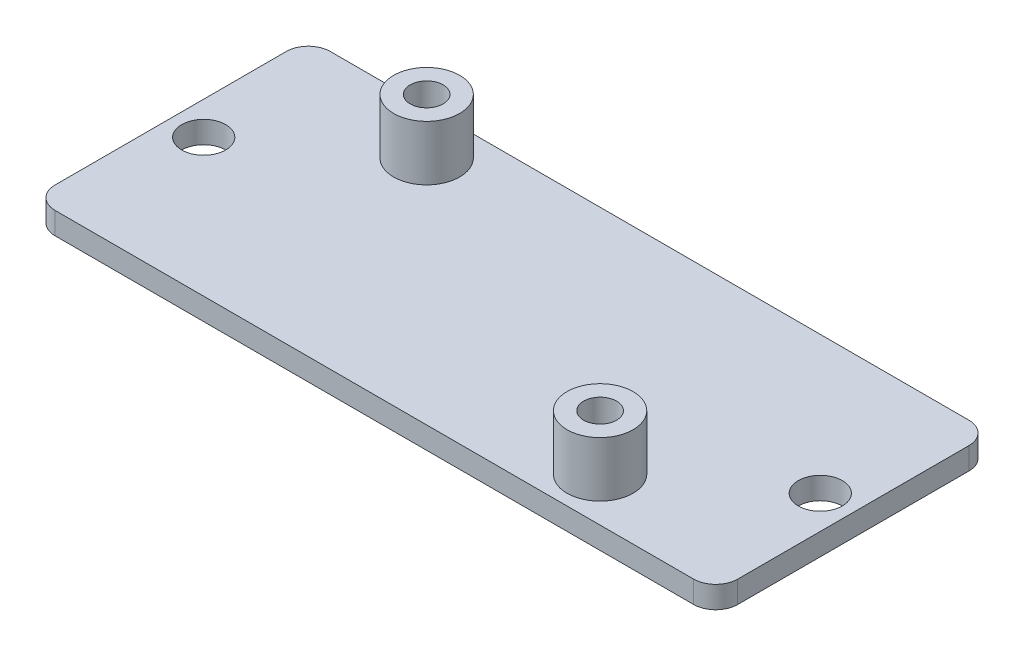
ISO-10303-21;
HEADER;
FILE_DESCRIPTION(('STEP AP214'),'2;1');
FILE_NAME('part.step','',(''),(''),'','','');
FILE_SCHEMA(('AUTOMOTIVE_DESIGN { 1 0 10303 214 1 1 1 1 }'));
ENDSEC;
DATA;
#1=APPLICATION_CONTEXT('core data for automotive mechanical design processes');
#2=APPLICATION_PROTOCOL_DEFINITION('international standard','automotive_design',2000,#1);
#3=PRODUCT_CONTEXT('',#1,'mechanical');
#4=PRODUCT('Part','Part','',(#3));
#5=PRODUCT_RELATED_PRODUCT_CATEGORY('part','',(#4));
#6=PRODUCT_DEFINITION_FORMATION('','',#4);
#7=PRODUCT_DEFINITION_CONTEXT('part definition',#1,'design');
#8=PRODUCT_DEFINITION('design','',#6,#7);
#9=PRODUCT_DEFINITION_SHAPE('','',#8);
#10=(LENGTH_UNIT() NAMED_UNIT(*) SI_UNIT(.MILLI.,.METRE.));
#11=(NAMED_UNIT(*) PLANE_ANGLE_UNIT() SI_UNIT($,.RADIAN.));
#12=(NAMED_UNIT(*) SI_UNIT($,.STERADIAN.) SOLID_ANGLE_UNIT());
#13=UNCERTAINTY_MEASURE_WITH_UNIT(LENGTH_MEASURE(1.E-05),#10,'distance_accuracy_value','');
#14=(GEOMETRIC_REPRESENTATION_CONTEXT(3) GLOBAL_UNCERTAINTY_ASSIGNED_CONTEXT((#13)) GLOBAL_UNIT_ASSIGNED_CONTEXT((#10,
#11,#12)) REPRESENTATION_CONTEXT('',''));
#15=CARTESIAN_POINT('',(0.,0.,0.));
#16=DIRECTION('',(0.,0.,1.));
#17=DIRECTION('',(1.,0.,0.));
#18=AXIS2_PLACEMENT_3D('',#15,#16,#17);
#19=CARTESIAN_POINT('',(60.,2.,2.));
#20=DIRECTION('',(0.,1.,0.));
#21=DIRECTION('',(0.,0.,1.));
#22=AXIS2_PLACEMENT_3D('',#19,#20,#21);
#23=CYLINDRICAL_SURFACE('',#22,2.);
#24=DIRECTION('',(0.,1.,0.));
#25=VECTOR('',#24,1.);
#26=CARTESIAN_POINT('',(62.,2.,2.));
#27=LINE('',#26,#25);
#28=CARTESIAN_POINT('',(62.,0.,2.));
#29=VERTEX_POINT('',#28);
#30=CARTESIAN_POINT('',(62.,2.,2.));
#31=VERTEX_POINT('',#30);
#32=EDGE_CURVE('E149',#29,#31,#27,.T.);
#33=ORIENTED_EDGE('',*,*,#32,.F.);
#34=CARTESIAN_POINT('',(60.,0.,2.));
#35=DIRECTION('',(0.,1.,0.));
#36=DIRECTION('',(0.,0.,1.));
#37=AXIS2_PLACEMENT_3D('',#34,#35,#36);
#38=CIRCLE('',#37,2.);
#39=CARTESIAN_POINT('',(60.,0.,0.));
#40=VERTEX_POINT('',#39);
#41=EDGE_CURVE('E41',#40,#29,#38,.F.);
#42=ORIENTED_EDGE('',*,*,#41,.F.);
#43=DIRECTION('',(0.,1.,0.));
#44=VECTOR('',#43,1.);
#45=CARTESIAN_POINT('',(60.,2.,0.));
#46=LINE('',#45,#44);
#47=CARTESIAN_POINT('',(60.,2.,0.));
#48=VERTEX_POINT('',#47);
#49=EDGE_CURVE('E101',#48,#40,#46,.F.);
#50=ORIENTED_EDGE('',*,*,#49,.F.);
#51=CARTESIAN_POINT('',(60.,2.,2.));
#52=DIRECTION('',(0.,1.,0.));
#53=DIRECTION('',(0.,0.,1.));
#54=AXIS2_PLACEMENT_3D('',#51,#52,#53);
#55=CIRCLE('',#54,2.);
#56=EDGE_CURVE('E11',#31,#48,#55,.T.);
#57=ORIENTED_EDGE('',*,*,#56,.F.);
#58=EDGE_LOOP('',(#33,#42,#50,#57));
#59=FACE_BOUND('',#58,.T.);
#60=ADVANCED_FACE('F34',(#59),#23,.T.);
#61=CARTESIAN_POINT('',(60.,2.,23.));
#62=DIRECTION('',(0.,1.,0.));
#63=DIRECTION('',(0.,0.,1.));
#64=AXIS2_PLACEMENT_3D('',#61,#62,#63);
#65=CYLINDRICAL_SURFACE('',#64,2.);
#66=DIRECTION('',(0.,1.,0.));
#67=VECTOR('',#66,1.);
#68=CARTESIAN_POINT('',(60.,2.,25.));
#69=LINE('',#68,#67);
#70=CARTESIAN_POINT('',(60.,0.,25.));
#71=VERTEX_POINT('',#70);
#72=CARTESIAN_POINT('',(60.,2.,25.));
#73=VERTEX_POINT('',#72);
#74=EDGE_CURVE('E139',#71,#73,#69,.T.);
#75=ORIENTED_EDGE('',*,*,#74,.F.);
#76=CARTESIAN_POINT('',(60.,0.,23.));
#77=DIRECTION('',(0.,1.,0.));
#78=DIRECTION('',(0.,0.,1.));
#79=AXIS2_PLACEMENT_3D('',#76,#77,#78);
#80=CIRCLE('',#79,2.);
#81=CARTESIAN_POINT('',(62.,0.,23.));
#82=VERTEX_POINT('',#81);
#83=EDGE_CURVE('E145',#82,#71,#80,.F.);
#84=ORIENTED_EDGE('',*,*,#83,.F.);
#85=DIRECTION('',(0.,1.,0.));
#86=VECTOR('',#85,1.);
#87=CARTESIAN_POINT('',(62.,2.,23.));
#88=LINE('',#87,#86);
#89=CARTESIAN_POINT('',(62.,2.,23.));
#90=VERTEX_POINT('',#89);
#91=EDGE_CURVE('E142',#90,#82,#88,.F.);
#92=ORIENTED_EDGE('',*,*,#91,.F.);
#93=CARTESIAN_POINT('',(60.,2.,23.));
#94=DIRECTION('',(0.,1.,0.));
#95=DIRECTION('',(0.,0.,1.));
#96=AXIS2_PLACEMENT_3D('',#93,#94,#95);
#97=CIRCLE('',#96,2.);
#98=EDGE_CURVE('E147',#73,#90,#97,.T.);
#99=ORIENTED_EDGE('',*,*,#98,.F.);
#100=EDGE_LOOP('',(#75,#84,#92,#99));
#101=FACE_BOUND('',#100,.T.);
#102=ADVANCED_FACE('F211',(#101),#65,.T.);
#103=CARTESIAN_POINT('',(2.,2.,23.));
#104=DIRECTION('',(0.,1.,0.));
#105=DIRECTION('',(0.,0.,1.));
#106=AXIS2_PLACEMENT_3D('',#103,#104,#105);
#107=CYLINDRICAL_SURFACE('',#106,2.);
#108=DIRECTION('',(0.,1.,0.));
#109=VECTOR('',#108,1.);
#110=CARTESIAN_POINT('',(0.,2.,23.));
#111=LINE('',#110,#109);
#112=CARTESIAN_POINT('',(0.,0.,23.));
#113=VERTEX_POINT('',#112);
#114=CARTESIAN_POINT('',(0.,2.,23.));
#115=VERTEX_POINT('',#114);
#116=EDGE_CURVE('E129',#113,#115,#111,.T.);
#117=ORIENTED_EDGE('',*,*,#116,.F.);
#118=CARTESIAN_POINT('',(2.,0.,23.));
#119=DIRECTION('',(0.,1.,0.));
#120=DIRECTION('',(0.,0.,1.));
#121=AXIS2_PLACEMENT_3D('',#118,#119,#120);
#122=CIRCLE('',#121,2.);
#123=CARTESIAN_POINT('',(2.,0.,25.));
#124=VERTEX_POINT('',#123);
#125=EDGE_CURVE('E135',#124,#113,#122,.F.);
#126=ORIENTED_EDGE('',*,*,#125,.F.);
#127=DIRECTION('',(0.,1.,0.));
#128=VECTOR('',#127,1.);
#129=CARTESIAN_POINT('',(2.,2.,25.));
#130=LINE('',#129,#128);
#131=CARTESIAN_POINT('',(2.,2.,25.));
#132=VERTEX_POINT('',#131);
#133=EDGE_CURVE('E132',#132,#124,#130,.F.);
#134=ORIENTED_EDGE('',*,*,#133,.F.);
#135=CARTESIAN_POINT('',(2.,2.,23.));
#136=DIRECTION('',(0.,1.,0.));
#137=DIRECTION('',(0.,0.,1.));
#138=AXIS2_PLACEMENT_3D('',#135,#136,#137);
#139=CIRCLE('',#138,2.);
#140=EDGE_CURVE('E137',#115,#132,#139,.T.);
#141=ORIENTED_EDGE('',*,*,#140,.F.);
#142=EDGE_LOOP('',(#117,#126,#134,#141));
#143=FACE_BOUND('',#142,.T.);
#144=ADVANCED_FACE('F205',(#143),#107,.T.);
#145=CARTESIAN_POINT('',(2.,2.,2.));
#146=DIRECTION('',(0.,1.,0.));
#147=DIRECTION('',(0.,0.,1.));
#148=AXIS2_PLACEMENT_3D('',#145,#146,#147);
#149=CYLINDRICAL_SURFACE('',#148,2.);
#150=DIRECTION('',(0.,1.,0.));
#151=VECTOR('',#150,1.);
#152=CARTESIAN_POINT('',(2.,2.,0.));
#153=LINE('',#152,#151);
#154=CARTESIAN_POINT('',(2.,0.,0.));
#155=VERTEX_POINT('',#154);
#156=CARTESIAN_POINT('',(2.,2.,0.));
#157=VERTEX_POINT('',#156);
#158=EDGE_CURVE('E100',#155,#157,#153,.T.);
#159=ORIENTED_EDGE('',*,*,#158,.F.);
#160=CARTESIAN_POINT('',(2.,0.,2.));
#161=DIRECTION('',(0.,1.,0.));
#162=DIRECTION('',(0.,0.,1.));
#163=AXIS2_PLACEMENT_3D('',#160,#161,#162);
#164=CIRCLE('',#163,2.);
#165=CARTESIAN_POINT('',(0.,0.,2.));
#166=VERTEX_POINT('',#165);
#167=EDGE_CURVE('E107',#166,#155,#164,.F.);
#168=ORIENTED_EDGE('',*,*,#167,.F.);
#169=DIRECTION('',(0.,1.,0.));
#170=VECTOR('',#169,1.);
#171=CARTESIAN_POINT('',(0.,2.,2.));
#172=LINE('',#171,#170);
#173=CARTESIAN_POINT('',(0.,2.,2.));
#174=VERTEX_POINT('',#173);
#175=EDGE_CURVE('E115',#174,#166,#172,.F.);
#176=ORIENTED_EDGE('',*,*,#175,.F.);
#177=CARTESIAN_POINT('',(2.,2.,2.));
#178=DIRECTION('',(0.,1.,0.));
#179=DIRECTION('',(0.,0.,1.));
#180=AXIS2_PLACEMENT_3D('',#177,#178,#179);
#181=CIRCLE('',#180,2.);
#182=EDGE_CURVE('E114',#157,#174,#181,.T.);
#183=ORIENTED_EDGE('',*,*,#182,.F.);
#184=EDGE_LOOP('',(#159,#168,#176,#183));
#185=FACE_BOUND('',#184,.T.);
#186=ADVANCED_FACE('F118',(#185),#149,.T.);
#187=CARTESIAN_POINT('',(0.,2.,0.));
#188=DIRECTION('',(1.,0.,0.));
#189=DIRECTION('',(0.,0.,-1.));
#190=AXIS2_PLACEMENT_3D('',#187,#188,#189);
#191=PLANE('',#190);
#192=DIRECTION('',(0.,0.,1.));
#193=VECTOR('',#192,1.);
#194=CARTESIAN_POINT('',(0.,0.,0.));
#195=LINE('',#194,#193);
#196=EDGE_CURVE('E110',#166,#113,#195,.T.);
#197=ORIENTED_EDGE('',*,*,#196,.T.);
#198=ORIENTED_EDGE('',*,*,#116,.T.);
#199=DIRECTION('',(0.,0.,1.));
#200=VECTOR('',#199,1.);
#201=CARTESIAN_POINT('',(0.,2.,0.));
#202=LINE('',#201,#200);
#203=EDGE_CURVE('E103',#174,#115,#202,.T.);
#204=ORIENTED_EDGE('',*,*,#203,.F.);
#205=ORIENTED_EDGE('',*,*,#175,.T.);
#206=EDGE_LOOP('',(#197,#198,#204,#205));
#207=FACE_BOUND('',#206,.T.);
#208=ADVANCED_FACE('F198',(#207),#191,.F.);
#209=CARTESIAN_POINT('',(0.,2.,25.));
#210=DIRECTION('',(0.,0.,-1.));
#211=DIRECTION('',(-1.,0.,0.));
#212=AXIS2_PLACEMENT_3D('',#209,#210,#211);
#213=PLANE('',#212);
#214=DIRECTION('',(1.,0.,0.));
#215=VECTOR('',#214,1.);
#216=CARTESIAN_POINT('',(0.,0.,25.));
#217=LINE('',#216,#215);
#218=EDGE_CURVE('E158',#124,#71,#217,.T.);
#219=ORIENTED_EDGE('',*,*,#218,.T.);
#220=ORIENTED_EDGE('',*,*,#74,.T.);
#221=DIRECTION('',(1.,0.,0.));
#222=VECTOR('',#221,1.);
#223=CARTESIAN_POINT('',(0.,2.,25.));
#224=LINE('',#223,#222);
#225=EDGE_CURVE('E194',#132,#73,#224,.T.);
#226=ORIENTED_EDGE('',*,*,#225,.F.);
#227=ORIENTED_EDGE('',*,*,#133,.T.);
#228=EDGE_LOOP('',(#219,#220,#226,#227));
#229=FACE_BOUND('',#228,.T.);
#230=ADVANCED_FACE('F208',(#229),#213,.F.);
#231=CARTESIAN_POINT('',(62.,2.,0.));
#232=DIRECTION('',(-1.,0.,0.));
#233=DIRECTION('',(0.,0.,1.));
#234=AXIS2_PLACEMENT_3D('',#231,#232,#233);
#235=PLANE('',#234);
#236=DIRECTION('',(0.,0.,-1.));
#237=VECTOR('',#236,1.);
#238=CARTESIAN_POINT('',(62.,0.,0.));
#239=LINE('',#238,#237);
#240=EDGE_CURVE('E104',#82,#29,#239,.T.);
#241=ORIENTED_EDGE('',*,*,#240,.T.);
#242=ORIENTED_EDGE('',*,*,#32,.T.);
#243=DIRECTION('',(0.,0.,-1.));
#244=VECTOR('',#243,1.);
#245=CARTESIAN_POINT('',(62.,2.,0.));
#246=LINE('',#245,#244);
#247=EDGE_CURVE('E122',#90,#31,#246,.T.);
#248=ORIENTED_EDGE('',*,*,#247,.F.);
#249=ORIENTED_EDGE('',*,*,#91,.T.);
#250=EDGE_LOOP('',(#241,#242,#248,#249));
#251=FACE_BOUND('',#250,.T.);
#252=ADVANCED_FACE('F156',(#251),#235,.F.);
#253=CARTESIAN_POINT('',(0.,2.,0.));
#254=DIRECTION('',(0.,0.,1.));
#255=DIRECTION('',(1.,0.,0.));
#256=AXIS2_PLACEMENT_3D('',#253,#254,#255);
#257=PLANE('',#256);
#258=DIRECTION('',(-1.,0.,0.));
#259=VECTOR('',#258,1.);
#260=CARTESIAN_POINT('',(0.,2.,0.));
#261=LINE('',#260,#259);
#262=EDGE_CURVE('E119',#48,#157,#261,.T.);
#263=ORIENTED_EDGE('',*,*,#262,.F.);
#264=ORIENTED_EDGE('',*,*,#49,.T.);
#265=DIRECTION('',(-1.,0.,0.));
#266=VECTOR('',#265,1.);
#267=CARTESIAN_POINT('',(0.,0.,0.));
#268=LINE('',#267,#266);
#269=EDGE_CURVE('E95',#40,#155,#268,.T.);
#270=ORIENTED_EDGE('',*,*,#269,.T.);
#271=ORIENTED_EDGE('',*,*,#158,.T.);
#272=EDGE_LOOP('',(#263,#264,#270,#271));
#273=FACE_BOUND('',#272,.T.);
#274=ADVANCED_FACE('F98',(#273),#257,.F.);
#275=CARTESIAN_POINT('',(0.,2.,0.));
#276=DIRECTION('',(0.,1.,0.));
#277=DIRECTION('',(0.,0.,1.));
#278=AXIS2_PLACEMENT_3D('',#275,#276,#277);
#279=PLANE('',#278);
#280=CARTESIAN_POINT('',(3.,2.,12.5));
#281=DIRECTION('',(0.,1.,0.));
#282=DIRECTION('',(0.,0.,1.));
#283=AXIS2_PLACEMENT_3D('',#280,#281,#282);
#284=CIRCLE('',#283,2.);
#285=CARTESIAN_POINT('',(3.,2.,14.5));
#286=VERTEX_POINT('',#285);
#287=EDGE_CURVE('E176',#286,#286,#284,.T.);
#288=ORIENTED_EDGE('',*,*,#287,.F.);
#289=EDGE_LOOP('',(#288));
#290=FACE_BOUND('',#289,.T.);
#291=CARTESIAN_POINT('',(59.,2.,12.5));
#292=DIRECTION('',(0.,1.,0.));
#293=DIRECTION('',(0.,0.,1.));
#294=AXIS2_PLACEMENT_3D('',#291,#292,#293);
#295=CIRCLE('',#294,2.);
#296=CARTESIAN_POINT('',(59.,2.,14.5));
#297=VERTEX_POINT('',#296);
#298=EDGE_CURVE('E273',#297,#297,#295,.T.);
#299=ORIENTED_EDGE('',*,*,#298,.F.);
#300=EDGE_LOOP('',(#299));
#301=FACE_BOUND('',#300,.T.);
#302=CARTESIAN_POINT('',(47.5,2.,21.));
#303=DIRECTION('',(0.,1.,0.));
#304=DIRECTION('',(0.,0.,1.));
#305=AXIS2_PLACEMENT_3D('',#302,#303,#304);
#306=CIRCLE('',#305,3.);
#307=CARTESIAN_POINT('',(47.5,2.,24.));
#308=VERTEX_POINT('',#307);
#309=EDGE_CURVE('E169',#308,#308,#306,.T.);
#310=ORIENTED_EDGE('',*,*,#309,.F.);
#311=EDGE_LOOP('',(#310));
#312=FACE_BOUND('',#311,.T.);
#313=CARTESIAN_POINT('',(14.75,2.,4.));
#314=DIRECTION('',(0.,1.,0.));
#315=DIRECTION('',(0.,0.,1.));
#316=AXIS2_PLACEMENT_3D('',#313,#314,#315);
#317=CIRCLE('',#316,3.);
#318=CARTESIAN_POINT('',(14.75,2.,7.));
#319=VERTEX_POINT('',#318);
#320=EDGE_CURVE('E184',#319,#319,#317,.T.);
#321=ORIENTED_EDGE('',*,*,#320,.F.);
#322=EDGE_LOOP('',(#321));
#323=FACE_BOUND('',#322,.T.);
#324=ORIENTED_EDGE('',*,*,#247,.T.);
#325=ORIENTED_EDGE('',*,*,#56,.T.);
#326=ORIENTED_EDGE('',*,*,#262,.T.);
#327=ORIENTED_EDGE('',*,*,#182,.T.);
#328=ORIENTED_EDGE('',*,*,#203,.T.);
#329=ORIENTED_EDGE('',*,*,#140,.T.);
#330=ORIENTED_EDGE('',*,*,#225,.T.);
#331=ORIENTED_EDGE('',*,*,#98,.T.);
#332=EDGE_LOOP('',(#324,#325,#326,#327,#328,#329,#330,#331));
#333=FACE_BOUND('',#332,.T.);
#334=ADVANCED_FACE('F201',(#290,#301,#312,#323,#333),#279,.T.);
#335=CARTESIAN_POINT('',(0.,0.,0.));
#336=DIRECTION('',(0.,1.,0.));
#337=DIRECTION('',(0.,0.,1.));
#338=AXIS2_PLACEMENT_3D('',#335,#336,#337);
#339=PLANE('',#338);
#340=CARTESIAN_POINT('',(3.,0.,12.5));
#341=DIRECTION('',(0.,1.,0.));
#342=DIRECTION('',(0.,0.,1.));
#343=AXIS2_PLACEMENT_3D('',#340,#341,#342);
#344=CIRCLE('',#343,2.);
#345=CARTESIAN_POINT('',(3.,0.,14.5));
#346=VERTEX_POINT('',#345);
#347=EDGE_CURVE('E272',#346,#346,#344,.T.);
#348=ORIENTED_EDGE('',*,*,#347,.T.);
#349=EDGE_LOOP('',(#348));
#350=FACE_BOUND('',#349,.T.);
#351=CARTESIAN_POINT('',(59.,0.,12.5));
#352=DIRECTION('',(0.,1.,0.));
#353=DIRECTION('',(0.,0.,1.));
#354=AXIS2_PLACEMENT_3D('',#351,#352,#353);
#355=CIRCLE('',#354,2.);
#356=CARTESIAN_POINT('',(59.,0.,14.5));
#357=VERTEX_POINT('',#356);
#358=EDGE_CURVE('E274',#357,#357,#355,.T.);
#359=ORIENTED_EDGE('',*,*,#358,.T.);
#360=EDGE_LOOP('',(#359));
#361=FACE_BOUND('',#360,.T.);
#362=CARTESIAN_POINT('',(14.75,0.,4.));
#363=DIRECTION('',(0.,1.,0.));
#364=DIRECTION('',(0.,0.,1.));
#365=AXIS2_PLACEMENT_3D('',#362,#363,#364);
#366=CIRCLE('',#365,1.5);
#367=CARTESIAN_POINT('',(14.75,0.,5.5));
#368=VERTEX_POINT('',#367);
#369=EDGE_CURVE('E165',#368,#368,#366,.T.);
#370=ORIENTED_EDGE('',*,*,#369,.T.);
#371=EDGE_LOOP('',(#370));
#372=FACE_BOUND('',#371,.T.);
#373=CARTESIAN_POINT('',(47.5,0.,21.));
#374=DIRECTION('',(0.,1.,0.));
#375=DIRECTION('',(0.,0.,1.));
#376=AXIS2_PLACEMENT_3D('',#373,#374,#375);
#377=CIRCLE('',#376,1.5);
#378=CARTESIAN_POINT('',(47.5,0.,22.5));
#379=VERTEX_POINT('',#378);
#380=EDGE_CURVE('E171',#379,#379,#377,.T.);
#381=ORIENTED_EDGE('',*,*,#380,.T.);
#382=EDGE_LOOP('',(#381));
#383=FACE_BOUND('',#382,.T.);
#384=ORIENTED_EDGE('',*,*,#269,.F.);
#385=ORIENTED_EDGE('',*,*,#41,.T.);
#386=ORIENTED_EDGE('',*,*,#240,.F.);
#387=ORIENTED_EDGE('',*,*,#83,.T.);
#388=ORIENTED_EDGE('',*,*,#218,.F.);
#389=ORIENTED_EDGE('',*,*,#125,.T.);
#390=ORIENTED_EDGE('',*,*,#196,.F.);
#391=ORIENTED_EDGE('',*,*,#167,.T.);
#392=EDGE_LOOP('',(#384,#385,#386,#387,#388,#389,#390,#391));
#393=FACE_BOUND('',#392,.T.);
#394=ADVANCED_FACE('F108',(#350,#361,#372,#383,#393),#339,.F.);
#395=CARTESIAN_POINT('',(14.75,7.,4.));
#396=DIRECTION('',(0.,-1.,0.));
#397=DIRECTION('',(0.,0.,-1.));
#398=AXIS2_PLACEMENT_3D('',#395,#396,#397);
#399=CYLINDRICAL_SURFACE('',#398,3.);
#400=CARTESIAN_POINT('',(14.75,7.,4.));
#401=DIRECTION('',(0.,1.,0.));
#402=DIRECTION('',(0.,0.,1.));
#403=AXIS2_PLACEMENT_3D('',#400,#401,#402);
#404=CIRCLE('',#403,3.);
#405=CARTESIAN_POINT('',(14.75,7.,7.));
#406=VERTEX_POINT('',#405);
#407=EDGE_CURVE('E187',#406,#406,#404,.T.);
#408=ORIENTED_EDGE('',*,*,#407,.F.);
#409=EDGE_LOOP('',(#408));
#410=FACE_BOUND('',#409,.T.);
#411=ORIENTED_EDGE('',*,*,#320,.T.);
#412=EDGE_LOOP('',(#411));
#413=FACE_BOUND('',#412,.T.);
#414=ADVANCED_FACE('F231',(#410,#413),#399,.T.);
#415=CARTESIAN_POINT('',(14.75,7.,4.));
#416=DIRECTION('',(0.,1.,0.));
#417=DIRECTION('',(0.,0.,1.));
#418=AXIS2_PLACEMENT_3D('',#415,#416,#417);
#419=PLANE('',#418);
#420=CARTESIAN_POINT('',(14.75,7.,4.));
#421=DIRECTION('',(0.,1.,0.));
#422=DIRECTION('',(0.,0.,1.));
#423=AXIS2_PLACEMENT_3D('',#420,#421,#422);
#424=CIRCLE('',#423,1.5);
#425=CARTESIAN_POINT('',(14.75,7.,5.5));
#426=VERTEX_POINT('',#425);
#427=EDGE_CURVE('E125',#426,#426,#424,.T.);
#428=ORIENTED_EDGE('',*,*,#427,.F.);
#429=EDGE_LOOP('',(#428));
#430=FACE_BOUND('',#429,.T.);
#431=ORIENTED_EDGE('',*,*,#407,.T.);
#432=EDGE_LOOP('',(#431));
#433=FACE_BOUND('',#432,.T.);
#434=ADVANCED_FACE('F238',(#430,#433),#419,.T.);
#435=CARTESIAN_POINT('',(47.5,7.,21.));
#436=DIRECTION('',(0.,-1.,0.));
#437=DIRECTION('',(0.,0.,-1.));
#438=AXIS2_PLACEMENT_3D('',#435,#436,#437);
#439=CYLINDRICAL_SURFACE('',#438,3.);
#440=CARTESIAN_POINT('',(47.5,7.,21.));
#441=DIRECTION('',(0.,1.,0.));
#442=DIRECTION('',(0.,0.,1.));
#443=AXIS2_PLACEMENT_3D('',#440,#441,#442);
#444=CIRCLE('',#443,3.);
#445=CARTESIAN_POINT('',(47.5,7.,24.));
#446=VERTEX_POINT('',#445);
#447=EDGE_CURVE('E181',#446,#446,#444,.T.);
#448=ORIENTED_EDGE('',*,*,#447,.F.);
#449=EDGE_LOOP('',(#448));
#450=FACE_BOUND('',#449,.T.);
#451=ORIENTED_EDGE('',*,*,#309,.T.);
#452=EDGE_LOOP('',(#451));
#453=FACE_BOUND('',#452,.T.);
#454=ADVANCED_FACE('F242',(#450,#453),#439,.T.);
#455=CARTESIAN_POINT('',(47.5,7.,21.));
#456=DIRECTION('',(0.,1.,0.));
#457=DIRECTION('',(0.,0.,1.));
#458=AXIS2_PLACEMENT_3D('',#455,#456,#457);
#459=PLANE('',#458);
#460=CARTESIAN_POINT('',(47.5,7.,21.));
#461=DIRECTION('',(0.,1.,0.));
#462=DIRECTION('',(0.,0.,1.));
#463=AXIS2_PLACEMENT_3D('',#460,#461,#462);
#464=CIRCLE('',#463,1.5);
#465=CARTESIAN_POINT('',(47.5,7.,22.5));
#466=VERTEX_POINT('',#465);
#467=EDGE_CURVE('E163',#466,#466,#464,.T.);
#468=ORIENTED_EDGE('',*,*,#467,.F.);
#469=EDGE_LOOP('',(#468));
#470=FACE_BOUND('',#469,.T.);
#471=ORIENTED_EDGE('',*,*,#447,.T.);
#472=EDGE_LOOP('',(#471));
#473=FACE_BOUND('',#472,.T.);
#474=ADVANCED_FACE('F246',(#470,#473),#459,.T.);
#475=CARTESIAN_POINT('',(47.5,0.,21.));
#476=DIRECTION('',(0.,1.,0.));
#477=DIRECTION('',(0.,0.,1.));
#478=AXIS2_PLACEMENT_3D('',#475,#476,#477);
#479=CYLINDRICAL_SURFACE('',#478,1.5);
#480=ORIENTED_EDGE('',*,*,#467,.T.);
#481=EDGE_LOOP('',(#480));
#482=FACE_BOUND('',#481,.T.);
#483=ORIENTED_EDGE('',*,*,#380,.F.);
#484=EDGE_LOOP('',(#483));
#485=FACE_BOUND('',#484,.T.);
#486=ADVANCED_FACE('F250',(#482,#485),#479,.F.);
#487=CARTESIAN_POINT('',(14.75,0.,4.));
#488=DIRECTION('',(0.,1.,0.));
#489=DIRECTION('',(0.,0.,1.));
#490=AXIS2_PLACEMENT_3D('',#487,#488,#489);
#491=CYLINDRICAL_SURFACE('',#490,1.5);
#492=ORIENTED_EDGE('',*,*,#427,.T.);
#493=EDGE_LOOP('',(#492));
#494=FACE_BOUND('',#493,.T.);
#495=ORIENTED_EDGE('',*,*,#369,.F.);
#496=EDGE_LOOP('',(#495));
#497=FACE_BOUND('',#496,.T.);
#498=ADVANCED_FACE('F254',(#494,#497),#491,.F.);
#499=CARTESIAN_POINT('',(59.,0.,12.5));
#500=DIRECTION('',(0.,1.,0.));
#501=DIRECTION('',(0.,0.,1.));
#502=AXIS2_PLACEMENT_3D('',#499,#500,#501);
#503=CYLINDRICAL_SURFACE('',#502,2.);
#504=ORIENTED_EDGE('',*,*,#298,.T.);
#505=EDGE_LOOP('',(#504));
#506=FACE_BOUND('',#505,.T.);
#507=ORIENTED_EDGE('',*,*,#358,.F.);
#508=EDGE_LOOP('',(#507));
#509=FACE_BOUND('',#508,.T.);
#510=ADVANCED_FACE('F257',(#506,#509),#503,.F.);
#511=CARTESIAN_POINT('',(3.,0.,12.5));
#512=DIRECTION('',(0.,1.,0.));
#513=DIRECTION('',(0.,0.,1.));
#514=AXIS2_PLACEMENT_3D('',#511,#512,#513);
#515=CYLINDRICAL_SURFACE('',#514,2.);
#516=ORIENTED_EDGE('',*,*,#287,.T.);
#517=EDGE_LOOP('',(#516));
#518=FACE_BOUND('',#517,.T.);
#519=ORIENTED_EDGE('',*,*,#347,.F.);
#520=EDGE_LOOP('',(#519));
#521=FACE_BOUND('',#520,.T.);
#522=ADVANCED_FACE('F261',(#518,#521),#515,.F.);
#523=CLOSED_SHELL('',(#60,#102,#144,#186,#208,#230,#252,#274,#334,#394,#414,#434,#454,#474,#486,
#498,#510,#522));
#524=MANIFOLD_SOLID_BREP('B2',#523);
#525=ADVANCED_BREP_SHAPE_REPRESENTATION('',(#18,#524),#14);
#526=SHAPE_DEFINITION_REPRESENTATION(#9,#525);
ENDSEC;
END-ISO-10303-21;
